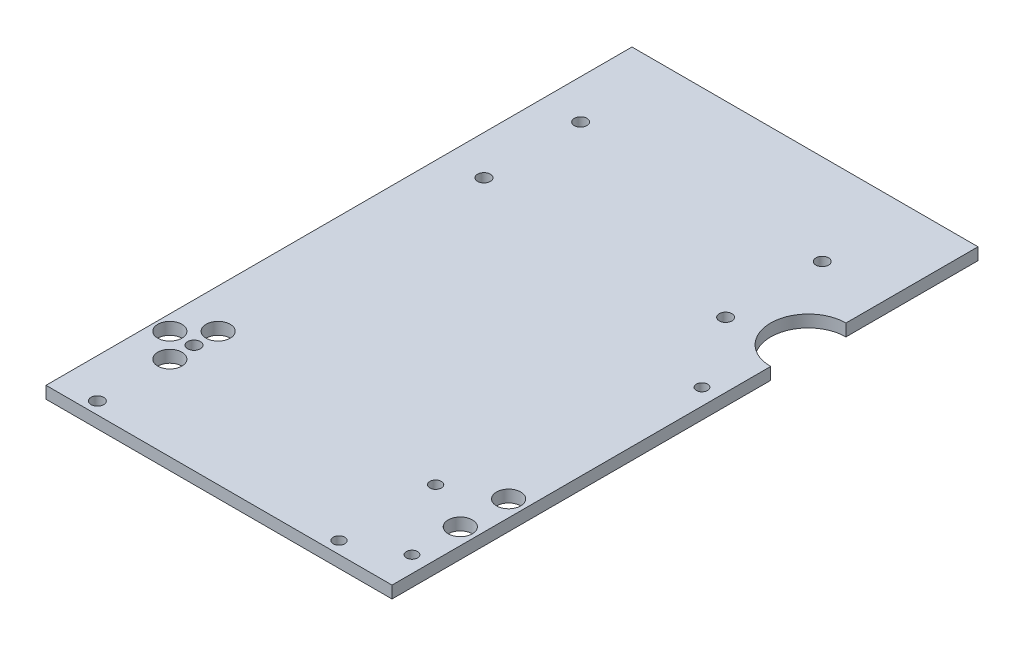
ISO-10303-21;
HEADER;
FILE_DESCRIPTION(('STEP AP214'),'2;1');
FILE_NAME('part.step','',(''),(''),'','','');
FILE_SCHEMA(('AUTOMOTIVE_DESIGN { 1 0 10303 214 1 1 1 1 }'));
ENDSEC;
DATA;
#1=APPLICATION_CONTEXT('core data for automotive mechanical design processes');
#2=APPLICATION_PROTOCOL_DEFINITION('international standard','automotive_design',2000,#1);
#3=PRODUCT_CONTEXT('',#1,'mechanical');
#4=PRODUCT('Part','Part','',(#3));
#5=PRODUCT_RELATED_PRODUCT_CATEGORY('part','',(#4));
#6=PRODUCT_DEFINITION_FORMATION('','',#4);
#7=PRODUCT_DEFINITION_CONTEXT('part definition',#1,'design');
#8=PRODUCT_DEFINITION('design','',#6,#7);
#9=PRODUCT_DEFINITION_SHAPE('','',#8);
#10=(LENGTH_UNIT() NAMED_UNIT(*) SI_UNIT(.MILLI.,.METRE.));
#11=(NAMED_UNIT(*) PLANE_ANGLE_UNIT() SI_UNIT($,.RADIAN.));
#12=(NAMED_UNIT(*) SI_UNIT($,.STERADIAN.) SOLID_ANGLE_UNIT());
#13=UNCERTAINTY_MEASURE_WITH_UNIT(LENGTH_MEASURE(1.E-05),#10,'distance_accuracy_value','');
#14=(GEOMETRIC_REPRESENTATION_CONTEXT(3) GLOBAL_UNCERTAINTY_ASSIGNED_CONTEXT((#13)) GLOBAL_UNIT_ASSIGNED_CONTEXT((#10,
#11,#12)) REPRESENTATION_CONTEXT('',''));
#15=CARTESIAN_POINT('',(0.,0.,0.));
#16=DIRECTION('',(0.,0.,1.));
#17=DIRECTION('',(1.,0.,0.));
#18=AXIS2_PLACEMENT_3D('',#15,#16,#17);
#19=CARTESIAN_POINT('',(-141.,-4.,139.759258716019));
#20=DIRECTION('',(-1.,0.,0.));
#21=DIRECTION('',(0.,0.,1.));
#22=AXIS2_PLACEMENT_3D('',#19,#20,#21);
#23=PLANE('',#22);
#24=DIRECTION('',(0.,0.,1.));
#25=VECTOR('',#24,1.);
#26=CARTESIAN_POINT('',(-141.,0.,139.759258716019));
#27=LINE('',#26,#25);
#28=CARTESIAN_POINT('',(-141.,0.,-54.2407412839806));
#29=VERTEX_POINT('',#28);
#30=CARTESIAN_POINT('',(-141.,0.,139.759258716019));
#31=VERTEX_POINT('',#30);
#32=EDGE_CURVE('E118',#29,#31,#27,.T.);
#33=ORIENTED_EDGE('',*,*,#32,.F.);
#34=DIRECTION('',(0.,1.,0.));
#35=VECTOR('',#34,1.);
#36=CARTESIAN_POINT('',(-141.,-4.,-54.2407412839806));
#37=LINE('',#36,#35);
#38=CARTESIAN_POINT('',(-141.,-4.,-54.2407412839806));
#39=VERTEX_POINT('',#38);
#40=EDGE_CURVE('E11',#39,#29,#37,.T.);
#41=ORIENTED_EDGE('',*,*,#40,.F.);
#42=DIRECTION('',(0.,0.,1.));
#43=VECTOR('',#42,1.);
#44=CARTESIAN_POINT('',(-141.,-4.,139.759258716019));
#45=LINE('',#44,#43);
#46=CARTESIAN_POINT('',(-141.,-4.,139.759258716019));
#47=VERTEX_POINT('',#46);
#48=EDGE_CURVE('E133',#39,#47,#45,.T.);
#49=ORIENTED_EDGE('',*,*,#48,.T.);
#50=DIRECTION('',(0.,1.,0.));
#51=VECTOR('',#50,1.);
#52=CARTESIAN_POINT('',(-141.,-4.,139.759258716019));
#53=LINE('',#52,#51);
#54=EDGE_CURVE('E36',#47,#31,#53,.T.);
#55=ORIENTED_EDGE('',*,*,#54,.T.);
#56=EDGE_LOOP('',(#33,#41,#49,#55));
#57=FACE_BOUND('',#56,.T.);
#58=ADVANCED_FACE('F33',(#57),#23,.T.);
#59=CARTESIAN_POINT('',(-141.,-4.,-54.2407412839806));
#60=DIRECTION('',(0.,0.,-1.));
#61=DIRECTION('',(-1.,0.,0.));
#62=AXIS2_PLACEMENT_3D('',#59,#60,#61);
#63=PLANE('',#62);
#64=DIRECTION('',(-1.,0.,0.));
#65=VECTOR('',#64,1.);
#66=CARTESIAN_POINT('',(-141.,0.,-54.2407412839806));
#67=LINE('',#66,#65);
#68=CARTESIAN_POINT('',(-26.44,0.,-54.2407412839806));
#69=VERTEX_POINT('',#68);
#70=EDGE_CURVE('E131',#69,#29,#67,.T.);
#71=ORIENTED_EDGE('',*,*,#70,.F.);
#72=DIRECTION('',(0.,1.,0.));
#73=VECTOR('',#72,1.);
#74=CARTESIAN_POINT('',(-26.44,-4.,-54.2407412839806));
#75=LINE('',#74,#73);
#76=CARTESIAN_POINT('',(-26.44,-4.,-54.2407412839806));
#77=VERTEX_POINT('',#76);
#78=EDGE_CURVE('E42',#77,#69,#75,.T.);
#79=ORIENTED_EDGE('',*,*,#78,.F.);
#80=DIRECTION('',(-1.,0.,0.));
#81=VECTOR('',#80,1.);
#82=CARTESIAN_POINT('',(-141.,-4.,-54.2407412839806));
#83=LINE('',#82,#81);
#84=EDGE_CURVE('E108',#77,#39,#83,.T.);
#85=ORIENTED_EDGE('',*,*,#84,.T.);
#86=ORIENTED_EDGE('',*,*,#40,.T.);
#87=EDGE_LOOP('',(#71,#79,#85,#86));
#88=FACE_BOUND('',#87,.T.);
#89=ADVANCED_FACE('F141',(#88),#63,.T.);
#90=CARTESIAN_POINT('',(-26.44,-4.,-10.5342735654368));
#91=DIRECTION('',(1.,0.,0.));
#92=DIRECTION('',(0.,0.,-1.));
#93=AXIS2_PLACEMENT_3D('',#90,#91,#92);
#94=PLANE('',#93);
#95=DIRECTION('',(0.,0.,-1.));
#96=VECTOR('',#95,1.);
#97=CARTESIAN_POINT('',(-26.44,0.,-10.5342735654368));
#98=LINE('',#97,#96);
#99=CARTESIAN_POINT('',(-26.44,0.,-10.5342735654368));
#100=VERTEX_POINT('',#99);
#101=EDGE_CURVE('E95',#100,#69,#98,.T.);
#102=ORIENTED_EDGE('',*,*,#101,.F.);
#103=DIRECTION('',(0.,1.,0.));
#104=VECTOR('',#103,1.);
#105=CARTESIAN_POINT('',(-26.44,-4.,-10.5342735654368));
#106=LINE('',#105,#104);
#107=CARTESIAN_POINT('',(-26.44,-4.,-10.5342735654368));
#108=VERTEX_POINT('',#107);
#109=EDGE_CURVE('E90',#108,#100,#106,.T.);
#110=ORIENTED_EDGE('',*,*,#109,.F.);
#111=DIRECTION('',(0.,0.,-1.));
#112=VECTOR('',#111,1.);
#113=CARTESIAN_POINT('',(-26.44,-4.,-10.5342735654368));
#114=LINE('',#113,#112);
#115=EDGE_CURVE('E93',#108,#77,#114,.T.);
#116=ORIENTED_EDGE('',*,*,#115,.T.);
#117=ORIENTED_EDGE('',*,*,#78,.T.);
#118=EDGE_LOOP('',(#102,#110,#116,#117));
#119=FACE_BOUND('',#118,.T.);
#120=ADVANCED_FACE('F92',(#119),#94,.T.);
#121=CARTESIAN_POINT('',(-26.44,-4.,1.93325471929562));
#122=DIRECTION('',(0.,1.,0.));
#123=DIRECTION('',(0.,0.,1.));
#124=AXIS2_PLACEMENT_3D('',#121,#122,#123);
#125=CYLINDRICAL_SURFACE('',#124,12.4675282847324);
#126=CARTESIAN_POINT('',(-26.44,0.,1.93325471929562));
#127=DIRECTION('',(0.,-1.,0.));
#128=DIRECTION('',(0.,0.,1.));
#129=AXIS2_PLACEMENT_3D('',#126,#127,#128);
#130=CIRCLE('',#129,12.4675282847324);
#131=CARTESIAN_POINT('',(-26.44,0.,14.400783004028));
#132=VERTEX_POINT('',#131);
#133=EDGE_CURVE('E128',#132,#100,#130,.T.);
#134=ORIENTED_EDGE('',*,*,#133,.F.);
#135=DIRECTION('',(0.,1.,0.));
#136=VECTOR('',#135,1.);
#137=CARTESIAN_POINT('',(-26.44,-4.,14.400783004028));
#138=LINE('',#137,#136);
#139=CARTESIAN_POINT('',(-26.44,-4.,14.400783004028));
#140=VERTEX_POINT('',#139);
#141=EDGE_CURVE('E100',#140,#132,#138,.T.);
#142=ORIENTED_EDGE('',*,*,#141,.F.);
#143=CARTESIAN_POINT('',(-26.44,-4.,1.93325471929562));
#144=DIRECTION('',(0.,-1.,0.));
#145=DIRECTION('',(0.,0.,1.));
#146=AXIS2_PLACEMENT_3D('',#143,#144,#145);
#147=CIRCLE('',#146,12.4675282847324);
#148=EDGE_CURVE('E106',#140,#108,#147,.T.);
#149=ORIENTED_EDGE('',*,*,#148,.T.);
#150=ORIENTED_EDGE('',*,*,#109,.T.);
#151=EDGE_LOOP('',(#134,#142,#149,#150));
#152=FACE_BOUND('',#151,.T.);
#153=ADVANCED_FACE('F110',(#152),#125,.F.);
#154=CARTESIAN_POINT('',(-26.44,-4.,139.759258716019));
#155=DIRECTION('',(1.,0.,0.));
#156=DIRECTION('',(0.,0.,-1.));
#157=AXIS2_PLACEMENT_3D('',#154,#155,#156);
#158=PLANE('',#157);
#159=DIRECTION('',(0.,0.,-1.));
#160=VECTOR('',#159,1.);
#161=CARTESIAN_POINT('',(-26.44,0.,139.759258716019));
#162=LINE('',#161,#160);
#163=CARTESIAN_POINT('',(-26.44,0.,139.759258716019));
#164=VERTEX_POINT('',#163);
#165=EDGE_CURVE('E125',#164,#132,#162,.T.);
#166=ORIENTED_EDGE('',*,*,#165,.F.);
#167=DIRECTION('',(0.,1.,0.));
#168=VECTOR('',#167,1.);
#169=CARTESIAN_POINT('',(-26.44,-4.,139.759258716019));
#170=LINE('',#169,#168);
#171=CARTESIAN_POINT('',(-26.44,-4.,139.759258716019));
#172=VERTEX_POINT('',#171);
#173=EDGE_CURVE('E136',#172,#164,#170,.T.);
#174=ORIENTED_EDGE('',*,*,#173,.F.);
#175=DIRECTION('',(0.,0.,-1.));
#176=VECTOR('',#175,1.);
#177=CARTESIAN_POINT('',(-26.44,-4.,139.759258716019));
#178=LINE('',#177,#176);
#179=EDGE_CURVE('E111',#172,#140,#178,.T.);
#180=ORIENTED_EDGE('',*,*,#179,.T.);
#181=ORIENTED_EDGE('',*,*,#141,.T.);
#182=EDGE_LOOP('',(#166,#174,#180,#181));
#183=FACE_BOUND('',#182,.T.);
#184=ADVANCED_FACE('F154',(#183),#158,.T.);
#185=CARTESIAN_POINT('',(-141.,-4.,139.759258716019));
#186=DIRECTION('',(0.,0.,1.));
#187=DIRECTION('',(1.,0.,0.));
#188=AXIS2_PLACEMENT_3D('',#185,#186,#187);
#189=PLANE('',#188);
#190=DIRECTION('',(1.,0.,0.));
#191=VECTOR('',#190,1.);
#192=CARTESIAN_POINT('',(-141.,0.,139.759258716019));
#193=LINE('',#192,#191);
#194=EDGE_CURVE('E121',#31,#164,#193,.T.);
#195=ORIENTED_EDGE('',*,*,#194,.F.);
#196=ORIENTED_EDGE('',*,*,#54,.F.);
#197=DIRECTION('',(1.,0.,0.));
#198=VECTOR('',#197,1.);
#199=CARTESIAN_POINT('',(-141.,-4.,139.759258716019));
#200=LINE('',#199,#198);
#201=EDGE_CURVE('E113',#47,#172,#200,.T.);
#202=ORIENTED_EDGE('',*,*,#201,.T.);
#203=ORIENTED_EDGE('',*,*,#173,.T.);
#204=EDGE_LOOP('',(#195,#196,#202,#203));
#205=FACE_BOUND('',#204,.T.);
#206=ADVANCED_FACE('F138',(#205),#189,.T.);
#207=CARTESIAN_POINT('',(-26.44,-4.,1.93325471929562));
#208=DIRECTION('',(0.,1.,0.));
#209=DIRECTION('',(0.,0.,1.));
#210=AXIS2_PLACEMENT_3D('',#207,#208,#209);
#211=PLANE('',#210);
#212=CARTESIAN_POINT('',(-31.84,-4.,95.759258716019));
#213=DIRECTION('',(0.,1.,0.));
#214=DIRECTION('',(0.,0.,1.));
#215=AXIS2_PLACEMENT_3D('',#212,#213,#214);
#216=CIRCLE('',#215,4.);
#217=CARTESIAN_POINT('',(-31.84,-4.,99.759258716019));
#218=VERTEX_POINT('',#217);
#219=EDGE_CURVE('E232',#218,#218,#216,.T.);
#220=ORIENTED_EDGE('',*,*,#219,.T.);
#221=EDGE_LOOP('',(#220));
#222=FACE_BOUND('',#221,.T.);
#223=CARTESIAN_POINT('',(-31.84,-4.,111.759258716019));
#224=DIRECTION('',(0.,1.,0.));
#225=DIRECTION('',(0.,0.,1.));
#226=AXIS2_PLACEMENT_3D('',#223,#224,#225);
#227=CIRCLE('',#226,4.);
#228=CARTESIAN_POINT('',(-31.84,-4.,115.759258716019));
#229=VERTEX_POINT('',#228);
#230=EDGE_CURVE('E240',#229,#229,#227,.T.);
#231=ORIENTED_EDGE('',*,*,#230,.T.);
#232=EDGE_LOOP('',(#231));
#233=FACE_BOUND('',#232,.T.);
#234=CARTESIAN_POINT('',(-48.0000000000998,-4.,-24.2407412838807));
#235=DIRECTION('',(0.,1.,0.));
#236=DIRECTION('',(0.,0.,1.));
#237=AXIS2_PLACEMENT_3D('',#234,#235,#236);
#238=CIRCLE('',#237,2.10000000010002);
#239=CARTESIAN_POINT('',(-48.0000000000998,-4.,-22.1407412837806));
#240=VERTEX_POINT('',#239);
#241=EDGE_CURVE('E246',#240,#240,#238,.T.);
#242=ORIENTED_EDGE('',*,*,#241,.T.);
#243=EDGE_LOOP('',(#242));
#244=FACE_BOUND('',#243,.T.);
#245=CARTESIAN_POINT('',(-48.0000000001001,-4.,7.75925871611929));
#246=DIRECTION('',(0.,1.,0.));
#247=DIRECTION('',(0.,0.,1.));
#248=AXIS2_PLACEMENT_3D('',#245,#246,#247);
#249=CIRCLE('',#248,2.10000000009999);
#250=CARTESIAN_POINT('',(-48.0000000001001,-4.,9.85925871621929));
#251=VERTEX_POINT('',#250);
#252=EDGE_CURVE('E252',#251,#251,#249,.T.);
#253=ORIENTED_EDGE('',*,*,#252,.T.);
#254=EDGE_LOOP('',(#253));
#255=FACE_BOUND('',#254,.T.);
#256=CARTESIAN_POINT('',(-128.0000000001,-4.,-24.2407412838806));
#257=DIRECTION('',(0.,1.,0.));
#258=DIRECTION('',(0.,0.,1.));
#259=AXIS2_PLACEMENT_3D('',#256,#257,#258);
#260=CIRCLE('',#259,2.10000000010003);
#261=CARTESIAN_POINT('',(-128.0000000001,-4.,-22.1407412837806));
#262=VERTEX_POINT('',#261);
#263=EDGE_CURVE('E258',#262,#262,#260,.T.);
#264=ORIENTED_EDGE('',*,*,#263,.T.);
#265=EDGE_LOOP('',(#264));
#266=FACE_BOUND('',#265,.T.);
#267=CARTESIAN_POINT('',(-128.0000000001,-4.,7.75925871611985));
#268=DIRECTION('',(0.,1.,0.));
#269=DIRECTION('',(0.,0.,1.));
#270=AXIS2_PLACEMENT_3D('',#267,#268,#269);
#271=CIRCLE('',#270,2.10000000010003);
#272=CARTESIAN_POINT('',(-128.0000000001,-4.,9.85925871621988));
#273=VERTEX_POINT('',#272);
#274=EDGE_CURVE('E264',#273,#273,#271,.T.);
#275=ORIENTED_EDGE('',*,*,#274,.T.);
#276=EDGE_LOOP('',(#275));
#277=FACE_BOUND('',#276,.T.);
#278=CARTESIAN_POINT('',(-128.,-4.,111.759258716019));
#279=DIRECTION('',(0.,1.,0.));
#280=DIRECTION('',(0.,0.,1.));
#281=AXIS2_PLACEMENT_3D('',#278,#279,#280);
#282=CIRCLE('',#281,4.00000000000001);
#283=CARTESIAN_POINT('',(-128.,-4.,115.759258716019));
#284=VERTEX_POINT('',#283);
#285=EDGE_CURVE('E270',#284,#284,#282,.T.);
#286=ORIENTED_EDGE('',*,*,#285,.T.);
#287=EDGE_LOOP('',(#286));
#288=FACE_BOUND('',#287,.T.);
#289=CARTESIAN_POINT('',(-128.,-4.,95.7592587160191));
#290=DIRECTION('',(0.,1.,0.));
#291=DIRECTION('',(0.,0.,1.));
#292=AXIS2_PLACEMENT_3D('',#289,#290,#291);
#293=CIRCLE('',#292,3.99999999999999);
#294=CARTESIAN_POINT('',(-128.,-4.,99.7592587160191));
#295=VERTEX_POINT('',#294);
#296=EDGE_CURVE('E276',#295,#295,#293,.T.);
#297=ORIENTED_EDGE('',*,*,#296,.T.);
#298=EDGE_LOOP('',(#297));
#299=FACE_BOUND('',#298,.T.);
#300=CARTESIAN_POINT('',(-136.,-4.,103.759258716019));
#301=DIRECTION('',(0.,1.,0.));
#302=DIRECTION('',(0.,0.,1.));
#303=AXIS2_PLACEMENT_3D('',#300,#301,#302);
#304=CIRCLE('',#303,3.99999999999999);
#305=CARTESIAN_POINT('',(-136.,-4.,107.759258716019));
#306=VERTEX_POINT('',#305);
#307=EDGE_CURVE('E282',#306,#306,#304,.T.);
#308=ORIENTED_EDGE('',*,*,#307,.T.);
#309=EDGE_LOOP('',(#308));
#310=FACE_BOUND('',#309,.T.);
#311=CARTESIAN_POINT('',(-127.9999999999,-4.,103.759258715919));
#312=DIRECTION('',(0.,1.,0.));
#313=DIRECTION('',(0.,0.,1.));
#314=AXIS2_PLACEMENT_3D('',#311,#312,#313);
#315=CIRCLE('',#314,2.10000000010003);
#316=CARTESIAN_POINT('',(-127.9999999999,-4.,105.859258716019));
#317=VERTEX_POINT('',#316);
#318=EDGE_CURVE('E288',#317,#317,#315,.T.);
#319=ORIENTED_EDGE('',*,*,#318,.T.);
#320=EDGE_LOOP('',(#319));
#321=FACE_BOUND('',#320,.T.);
#322=CARTESIAN_POINT('',(-127.9999999999,-4.,135.759258715919));
#323=DIRECTION('',(0.,1.,0.));
#324=DIRECTION('',(0.,0.,1.));
#325=AXIS2_PLACEMENT_3D('',#322,#323,#324);
#326=CIRCLE('',#325,2.10000000010001);
#327=CARTESIAN_POINT('',(-127.9999999999,-4.,137.859258716019));
#328=VERTEX_POINT('',#327);
#329=EDGE_CURVE('E294',#328,#328,#326,.T.);
#330=ORIENTED_EDGE('',*,*,#329,.T.);
#331=EDGE_LOOP('',(#330));
#332=FACE_BOUND('',#331,.T.);
#333=CARTESIAN_POINT('',(-47.9999999999008,-4.,103.759258715919));
#334=DIRECTION('',(0.,1.,0.));
#335=DIRECTION('',(0.,0.,1.));
#336=AXIS2_PLACEMENT_3D('',#333,#334,#335);
#337=CIRCLE('',#336,1.905);
#338=CARTESIAN_POINT('',(-47.9999999999008,-4.,105.664258715919));
#339=VERTEX_POINT('',#338);
#340=EDGE_CURVE('E300',#339,#339,#337,.T.);
#341=ORIENTED_EDGE('',*,*,#340,.T.);
#342=EDGE_LOOP('',(#341));
#343=FACE_BOUND('',#342,.T.);
#344=CARTESIAN_POINT('',(-47.9999999999001,-4.,135.759258715919));
#345=DIRECTION('',(0.,1.,0.));
#346=DIRECTION('',(0.,0.,1.));
#347=AXIS2_PLACEMENT_3D('',#344,#345,#346);
#348=CIRCLE('',#347,1.905);
#349=CARTESIAN_POINT('',(-47.9999999999001,-4.,137.664258715919));
#350=VERTEX_POINT('',#349);
#351=EDGE_CURVE('E306',#350,#350,#348,.T.);
#352=ORIENTED_EDGE('',*,*,#351,.T.);
#353=EDGE_LOOP('',(#352));
#354=FACE_BOUND('',#353,.T.);
#355=CARTESIAN_POINT('',(-31.84,-4.,127.759258716019));
#356=DIRECTION('',(0.,1.,0.));
#357=DIRECTION('',(0.,0.,1.));
#358=AXIS2_PLACEMENT_3D('',#355,#356,#357);
#359=CIRCLE('',#358,1.85000000000002);
#360=CARTESIAN_POINT('',(-31.84,-4.,129.609258716019));
#361=VERTEX_POINT('',#360);
#362=EDGE_CURVE('E312',#361,#361,#359,.T.);
#363=ORIENTED_EDGE('',*,*,#362,.T.);
#364=EDGE_LOOP('',(#363));
#365=FACE_BOUND('',#364,.T.);
#366=CARTESIAN_POINT('',(-31.84,-4.,31.759258716019));
#367=DIRECTION('',(0.,1.,0.));
#368=DIRECTION('',(0.,0.,1.));
#369=AXIS2_PLACEMENT_3D('',#366,#367,#368);
#370=CIRCLE('',#369,1.84999999999999);
#371=CARTESIAN_POINT('',(-31.84,-4.,33.609258716019));
#372=VERTEX_POINT('',#371);
#373=EDGE_CURVE('E122',#372,#372,#370,.T.);
#374=ORIENTED_EDGE('',*,*,#373,.T.);
#375=EDGE_LOOP('',(#374));
#376=FACE_BOUND('',#375,.T.);
#377=ORIENTED_EDGE('',*,*,#48,.F.);
#378=ORIENTED_EDGE('',*,*,#84,.F.);
#379=ORIENTED_EDGE('',*,*,#115,.F.);
#380=ORIENTED_EDGE('',*,*,#148,.F.);
#381=ORIENTED_EDGE('',*,*,#179,.F.);
#382=ORIENTED_EDGE('',*,*,#201,.F.);
#383=EDGE_LOOP('',(#377,#378,#379,#380,#381,#382));
#384=FACE_BOUND('',#383,.T.);
#385=ADVANCED_FACE('F104',(#222,#233,#244,#255,#266,#277,#288,#299,#310,#321,#332,#343,#354,
#365,#376,#384),#211,.F.);
#386=CARTESIAN_POINT('',(-26.44,0.,1.93325471929562));
#387=DIRECTION('',(0.,1.,0.));
#388=DIRECTION('',(0.,0.,1.));
#389=AXIS2_PLACEMENT_3D('',#386,#387,#388);
#390=PLANE('',#389);
#391=CARTESIAN_POINT('',(-31.84,0.,95.759258716019));
#392=DIRECTION('',(0.,1.,0.));
#393=DIRECTION('',(0.,0.,1.));
#394=AXIS2_PLACEMENT_3D('',#391,#392,#393);
#395=CIRCLE('',#394,4.);
#396=CARTESIAN_POINT('',(-31.84,0.,99.759258716019));
#397=VERTEX_POINT('',#396);
#398=EDGE_CURVE('E235',#397,#397,#395,.T.);
#399=ORIENTED_EDGE('',*,*,#398,.F.);
#400=EDGE_LOOP('',(#399));
#401=FACE_BOUND('',#400,.T.);
#402=CARTESIAN_POINT('',(-31.84,0.,111.759258716019));
#403=DIRECTION('',(0.,1.,0.));
#404=DIRECTION('',(0.,0.,1.));
#405=AXIS2_PLACEMENT_3D('',#402,#403,#404);
#406=CIRCLE('',#405,4.);
#407=CARTESIAN_POINT('',(-31.84,0.,115.759258716019));
#408=VERTEX_POINT('',#407);
#409=EDGE_CURVE('E237',#408,#408,#406,.T.);
#410=ORIENTED_EDGE('',*,*,#409,.F.);
#411=EDGE_LOOP('',(#410));
#412=FACE_BOUND('',#411,.T.);
#413=CARTESIAN_POINT('',(-48.0000000000998,0.,-24.2407412838807));
#414=DIRECTION('',(0.,1.,0.));
#415=DIRECTION('',(0.,0.,1.));
#416=AXIS2_PLACEMENT_3D('',#413,#414,#415);
#417=CIRCLE('',#416,2.10000000010002);
#418=CARTESIAN_POINT('',(-48.0000000000998,0.,-22.1407412837806));
#419=VERTEX_POINT('',#418);
#420=EDGE_CURVE('E243',#419,#419,#417,.T.);
#421=ORIENTED_EDGE('',*,*,#420,.F.);
#422=EDGE_LOOP('',(#421));
#423=FACE_BOUND('',#422,.T.);
#424=CARTESIAN_POINT('',(-48.0000000001001,0.,7.75925871611929));
#425=DIRECTION('',(0.,1.,0.));
#426=DIRECTION('',(0.,0.,1.));
#427=AXIS2_PLACEMENT_3D('',#424,#425,#426);
#428=CIRCLE('',#427,2.10000000009999);
#429=CARTESIAN_POINT('',(-48.0000000001001,0.,9.85925871621929));
#430=VERTEX_POINT('',#429);
#431=EDGE_CURVE('E249',#430,#430,#428,.T.);
#432=ORIENTED_EDGE('',*,*,#431,.F.);
#433=EDGE_LOOP('',(#432));
#434=FACE_BOUND('',#433,.T.);
#435=CARTESIAN_POINT('',(-128.0000000001,0.,-24.2407412838806));
#436=DIRECTION('',(0.,1.,0.));
#437=DIRECTION('',(0.,0.,1.));
#438=AXIS2_PLACEMENT_3D('',#435,#436,#437);
#439=CIRCLE('',#438,2.10000000010003);
#440=CARTESIAN_POINT('',(-128.0000000001,0.,-22.1407412837806));
#441=VERTEX_POINT('',#440);
#442=EDGE_CURVE('E255',#441,#441,#439,.T.);
#443=ORIENTED_EDGE('',*,*,#442,.F.);
#444=EDGE_LOOP('',(#443));
#445=FACE_BOUND('',#444,.T.);
#446=CARTESIAN_POINT('',(-128.0000000001,0.,7.75925871611985));
#447=DIRECTION('',(0.,1.,0.));
#448=DIRECTION('',(0.,0.,1.));
#449=AXIS2_PLACEMENT_3D('',#446,#447,#448);
#450=CIRCLE('',#449,2.10000000010003);
#451=CARTESIAN_POINT('',(-128.0000000001,0.,9.85925871621988));
#452=VERTEX_POINT('',#451);
#453=EDGE_CURVE('E261',#452,#452,#450,.T.);
#454=ORIENTED_EDGE('',*,*,#453,.F.);
#455=EDGE_LOOP('',(#454));
#456=FACE_BOUND('',#455,.T.);
#457=CARTESIAN_POINT('',(-128.,0.,111.759258716019));
#458=DIRECTION('',(0.,1.,0.));
#459=DIRECTION('',(0.,0.,1.));
#460=AXIS2_PLACEMENT_3D('',#457,#458,#459);
#461=CIRCLE('',#460,4.00000000000001);
#462=CARTESIAN_POINT('',(-128.,0.,115.759258716019));
#463=VERTEX_POINT('',#462);
#464=EDGE_CURVE('E267',#463,#463,#461,.T.);
#465=ORIENTED_EDGE('',*,*,#464,.F.);
#466=EDGE_LOOP('',(#465));
#467=FACE_BOUND('',#466,.T.);
#468=CARTESIAN_POINT('',(-128.,0.,95.7592587160191));
#469=DIRECTION('',(0.,1.,0.));
#470=DIRECTION('',(0.,0.,1.));
#471=AXIS2_PLACEMENT_3D('',#468,#469,#470);
#472=CIRCLE('',#471,3.99999999999999);
#473=CARTESIAN_POINT('',(-128.,0.,99.7592587160191));
#474=VERTEX_POINT('',#473);
#475=EDGE_CURVE('E273',#474,#474,#472,.T.);
#476=ORIENTED_EDGE('',*,*,#475,.F.);
#477=EDGE_LOOP('',(#476));
#478=FACE_BOUND('',#477,.T.);
#479=CARTESIAN_POINT('',(-136.,0.,103.759258716019));
#480=DIRECTION('',(0.,1.,0.));
#481=DIRECTION('',(0.,0.,1.));
#482=AXIS2_PLACEMENT_3D('',#479,#480,#481);
#483=CIRCLE('',#482,3.99999999999999);
#484=CARTESIAN_POINT('',(-136.,0.,107.759258716019));
#485=VERTEX_POINT('',#484);
#486=EDGE_CURVE('E279',#485,#485,#483,.T.);
#487=ORIENTED_EDGE('',*,*,#486,.F.);
#488=EDGE_LOOP('',(#487));
#489=FACE_BOUND('',#488,.T.);
#490=CARTESIAN_POINT('',(-127.9999999999,0.,103.759258715919));
#491=DIRECTION('',(0.,1.,0.));
#492=DIRECTION('',(0.,0.,1.));
#493=AXIS2_PLACEMENT_3D('',#490,#491,#492);
#494=CIRCLE('',#493,2.10000000010003);
#495=CARTESIAN_POINT('',(-127.9999999999,0.,105.859258716019));
#496=VERTEX_POINT('',#495);
#497=EDGE_CURVE('E285',#496,#496,#494,.T.);
#498=ORIENTED_EDGE('',*,*,#497,.F.);
#499=EDGE_LOOP('',(#498));
#500=FACE_BOUND('',#499,.T.);
#501=CARTESIAN_POINT('',(-127.9999999999,0.,135.759258715919));
#502=DIRECTION('',(0.,1.,0.));
#503=DIRECTION('',(0.,0.,1.));
#504=AXIS2_PLACEMENT_3D('',#501,#502,#503);
#505=CIRCLE('',#504,2.10000000010001);
#506=CARTESIAN_POINT('',(-127.9999999999,0.,137.859258716019));
#507=VERTEX_POINT('',#506);
#508=EDGE_CURVE('E291',#507,#507,#505,.T.);
#509=ORIENTED_EDGE('',*,*,#508,.F.);
#510=EDGE_LOOP('',(#509));
#511=FACE_BOUND('',#510,.T.);
#512=CARTESIAN_POINT('',(-47.9999999999008,0.,103.759258715919));
#513=DIRECTION('',(0.,1.,0.));
#514=DIRECTION('',(0.,0.,1.));
#515=AXIS2_PLACEMENT_3D('',#512,#513,#514);
#516=CIRCLE('',#515,1.905);
#517=CARTESIAN_POINT('',(-47.9999999999008,0.,105.664258715919));
#518=VERTEX_POINT('',#517);
#519=EDGE_CURVE('E297',#518,#518,#516,.T.);
#520=ORIENTED_EDGE('',*,*,#519,.F.);
#521=EDGE_LOOP('',(#520));
#522=FACE_BOUND('',#521,.T.);
#523=CARTESIAN_POINT('',(-47.9999999999001,0.,135.759258715919));
#524=DIRECTION('',(0.,1.,0.));
#525=DIRECTION('',(0.,0.,1.));
#526=AXIS2_PLACEMENT_3D('',#523,#524,#525);
#527=CIRCLE('',#526,1.905);
#528=CARTESIAN_POINT('',(-47.9999999999001,0.,137.664258715919));
#529=VERTEX_POINT('',#528);
#530=EDGE_CURVE('E303',#529,#529,#527,.T.);
#531=ORIENTED_EDGE('',*,*,#530,.F.);
#532=EDGE_LOOP('',(#531));
#533=FACE_BOUND('',#532,.T.);
#534=CARTESIAN_POINT('',(-31.84,0.,127.759258716019));
#535=DIRECTION('',(0.,1.,0.));
#536=DIRECTION('',(0.,0.,1.));
#537=AXIS2_PLACEMENT_3D('',#534,#535,#536);
#538=CIRCLE('',#537,1.85000000000002);
#539=CARTESIAN_POINT('',(-31.84,0.,129.609258716019));
#540=VERTEX_POINT('',#539);
#541=EDGE_CURVE('E309',#540,#540,#538,.T.);
#542=ORIENTED_EDGE('',*,*,#541,.F.);
#543=EDGE_LOOP('',(#542));
#544=FACE_BOUND('',#543,.T.);
#545=CARTESIAN_POINT('',(-31.84,0.,31.759258716019));
#546=DIRECTION('',(0.,1.,0.));
#547=DIRECTION('',(0.,0.,1.));
#548=AXIS2_PLACEMENT_3D('',#545,#546,#547);
#549=CIRCLE('',#548,1.84999999999999);
#550=CARTESIAN_POINT('',(-31.84,0.,33.609258716019));
#551=VERTEX_POINT('',#550);
#552=EDGE_CURVE('E315',#551,#551,#549,.T.);
#553=ORIENTED_EDGE('',*,*,#552,.F.);
#554=EDGE_LOOP('',(#553));
#555=FACE_BOUND('',#554,.T.);
#556=ORIENTED_EDGE('',*,*,#32,.T.);
#557=ORIENTED_EDGE('',*,*,#194,.T.);
#558=ORIENTED_EDGE('',*,*,#165,.T.);
#559=ORIENTED_EDGE('',*,*,#133,.T.);
#560=ORIENTED_EDGE('',*,*,#101,.T.);
#561=ORIENTED_EDGE('',*,*,#70,.T.);
#562=EDGE_LOOP('',(#556,#557,#558,#559,#560,#561));
#563=FACE_BOUND('',#562,.T.);
#564=ADVANCED_FACE('F140',(#401,#412,#423,#434,#445,#456,#467,#478,#489,#500,#511,#522,#533,
#544,#555,#563),#390,.T.);
#565=CARTESIAN_POINT('',(-31.84,-4.,31.759258716019));
#566=DIRECTION('',(0.,1.,0.));
#567=DIRECTION('',(0.,0.,1.));
#568=AXIS2_PLACEMENT_3D('',#565,#566,#567);
#569=CYLINDRICAL_SURFACE('',#568,1.84999999999999);
#570=ORIENTED_EDGE('',*,*,#373,.F.);
#571=EDGE_LOOP('',(#570));
#572=FACE_BOUND('',#571,.T.);
#573=ORIENTED_EDGE('',*,*,#552,.T.);
#574=EDGE_LOOP('',(#573));
#575=FACE_BOUND('',#574,.T.);
#576=ADVANCED_FACE('F165',(#572,#575),#569,.F.);
#577=CARTESIAN_POINT('',(-31.84,-4.,127.759258716019));
#578=DIRECTION('',(0.,1.,0.));
#579=DIRECTION('',(0.,0.,1.));
#580=AXIS2_PLACEMENT_3D('',#577,#578,#579);
#581=CYLINDRICAL_SURFACE('',#580,1.85000000000002);
#582=ORIENTED_EDGE('',*,*,#362,.F.);
#583=EDGE_LOOP('',(#582));
#584=FACE_BOUND('',#583,.T.);
#585=ORIENTED_EDGE('',*,*,#541,.T.);
#586=EDGE_LOOP('',(#585));
#587=FACE_BOUND('',#586,.T.);
#588=ADVANCED_FACE('F172',(#584,#587),#581,.F.);
#589=CARTESIAN_POINT('',(-47.9999999999001,-4.,135.759258715919));
#590=DIRECTION('',(0.,1.,0.));
#591=DIRECTION('',(0.,0.,1.));
#592=AXIS2_PLACEMENT_3D('',#589,#590,#591);
#593=CYLINDRICAL_SURFACE('',#592,1.905);
#594=ORIENTED_EDGE('',*,*,#351,.F.);
#595=EDGE_LOOP('',(#594));
#596=FACE_BOUND('',#595,.T.);
#597=ORIENTED_EDGE('',*,*,#530,.T.);
#598=EDGE_LOOP('',(#597));
#599=FACE_BOUND('',#598,.T.);
#600=ADVANCED_FACE('F176',(#596,#599),#593,.F.);
#601=CARTESIAN_POINT('',(-47.9999999999008,-4.,103.759258715919));
#602=DIRECTION('',(0.,1.,0.));
#603=DIRECTION('',(0.,0.,1.));
#604=AXIS2_PLACEMENT_3D('',#601,#602,#603);
#605=CYLINDRICAL_SURFACE('',#604,1.905);
#606=ORIENTED_EDGE('',*,*,#340,.F.);
#607=EDGE_LOOP('',(#606));
#608=FACE_BOUND('',#607,.T.);
#609=ORIENTED_EDGE('',*,*,#519,.T.);
#610=EDGE_LOOP('',(#609));
#611=FACE_BOUND('',#610,.T.);
#612=ADVANCED_FACE('F180',(#608,#611),#605,.F.);
#613=CARTESIAN_POINT('',(-127.9999999999,-4.,135.759258715919));
#614=DIRECTION('',(0.,1.,0.));
#615=DIRECTION('',(0.,0.,1.));
#616=AXIS2_PLACEMENT_3D('',#613,#614,#615);
#617=CYLINDRICAL_SURFACE('',#616,2.10000000010001);
#618=ORIENTED_EDGE('',*,*,#329,.F.);
#619=EDGE_LOOP('',(#618));
#620=FACE_BOUND('',#619,.T.);
#621=ORIENTED_EDGE('',*,*,#508,.T.);
#622=EDGE_LOOP('',(#621));
#623=FACE_BOUND('',#622,.T.);
#624=ADVANCED_FACE('F184',(#620,#623),#617,.F.);
#625=CARTESIAN_POINT('',(-127.9999999999,-4.,103.759258715919));
#626=DIRECTION('',(0.,1.,0.));
#627=DIRECTION('',(0.,0.,1.));
#628=AXIS2_PLACEMENT_3D('',#625,#626,#627);
#629=CYLINDRICAL_SURFACE('',#628,2.10000000010003);
#630=ORIENTED_EDGE('',*,*,#318,.F.);
#631=EDGE_LOOP('',(#630));
#632=FACE_BOUND('',#631,.T.);
#633=ORIENTED_EDGE('',*,*,#497,.T.);
#634=EDGE_LOOP('',(#633));
#635=FACE_BOUND('',#634,.T.);
#636=ADVANCED_FACE('F188',(#632,#635),#629,.F.);
#637=CARTESIAN_POINT('',(-136.,-4.,103.759258716019));
#638=DIRECTION('',(0.,1.,0.));
#639=DIRECTION('',(0.,0.,1.));
#640=AXIS2_PLACEMENT_3D('',#637,#638,#639);
#641=CYLINDRICAL_SURFACE('',#640,3.99999999999999);
#642=ORIENTED_EDGE('',*,*,#307,.F.);
#643=EDGE_LOOP('',(#642));
#644=FACE_BOUND('',#643,.T.);
#645=ORIENTED_EDGE('',*,*,#486,.T.);
#646=EDGE_LOOP('',(#645));
#647=FACE_BOUND('',#646,.T.);
#648=ADVANCED_FACE('F192',(#644,#647),#641,.F.);
#649=CARTESIAN_POINT('',(-128.,-4.,95.7592587160191));
#650=DIRECTION('',(0.,1.,0.));
#651=DIRECTION('',(0.,0.,1.));
#652=AXIS2_PLACEMENT_3D('',#649,#650,#651);
#653=CYLINDRICAL_SURFACE('',#652,3.99999999999999);
#654=ORIENTED_EDGE('',*,*,#296,.F.);
#655=EDGE_LOOP('',(#654));
#656=FACE_BOUND('',#655,.T.);
#657=ORIENTED_EDGE('',*,*,#475,.T.);
#658=EDGE_LOOP('',(#657));
#659=FACE_BOUND('',#658,.T.);
#660=ADVANCED_FACE('F196',(#656,#659),#653,.F.);
#661=CARTESIAN_POINT('',(-128.,-4.,111.759258716019));
#662=DIRECTION('',(0.,1.,0.));
#663=DIRECTION('',(0.,0.,1.));
#664=AXIS2_PLACEMENT_3D('',#661,#662,#663);
#665=CYLINDRICAL_SURFACE('',#664,4.00000000000001);
#666=ORIENTED_EDGE('',*,*,#285,.F.);
#667=EDGE_LOOP('',(#666));
#668=FACE_BOUND('',#667,.T.);
#669=ORIENTED_EDGE('',*,*,#464,.T.);
#670=EDGE_LOOP('',(#669));
#671=FACE_BOUND('',#670,.T.);
#672=ADVANCED_FACE('F200',(#668,#671),#665,.F.);
#673=CARTESIAN_POINT('',(-128.0000000001,-4.,7.75925871611985));
#674=DIRECTION('',(0.,1.,0.));
#675=DIRECTION('',(0.,0.,1.));
#676=AXIS2_PLACEMENT_3D('',#673,#674,#675);
#677=CYLINDRICAL_SURFACE('',#676,2.10000000010003);
#678=ORIENTED_EDGE('',*,*,#274,.F.);
#679=EDGE_LOOP('',(#678));
#680=FACE_BOUND('',#679,.T.);
#681=ORIENTED_EDGE('',*,*,#453,.T.);
#682=EDGE_LOOP('',(#681));
#683=FACE_BOUND('',#682,.T.);
#684=ADVANCED_FACE('F204',(#680,#683),#677,.F.);
#685=CARTESIAN_POINT('',(-128.0000000001,-4.,-24.2407412838806));
#686=DIRECTION('',(0.,1.,0.));
#687=DIRECTION('',(0.,0.,1.));
#688=AXIS2_PLACEMENT_3D('',#685,#686,#687);
#689=CYLINDRICAL_SURFACE('',#688,2.10000000010003);
#690=ORIENTED_EDGE('',*,*,#263,.F.);
#691=EDGE_LOOP('',(#690));
#692=FACE_BOUND('',#691,.T.);
#693=ORIENTED_EDGE('',*,*,#442,.T.);
#694=EDGE_LOOP('',(#693));
#695=FACE_BOUND('',#694,.T.);
#696=ADVANCED_FACE('F208',(#692,#695),#689,.F.);
#697=CARTESIAN_POINT('',(-48.0000000001001,-4.,7.75925871611929));
#698=DIRECTION('',(0.,1.,0.));
#699=DIRECTION('',(0.,0.,1.));
#700=AXIS2_PLACEMENT_3D('',#697,#698,#699);
#701=CYLINDRICAL_SURFACE('',#700,2.10000000009999);
#702=ORIENTED_EDGE('',*,*,#252,.F.);
#703=EDGE_LOOP('',(#702));
#704=FACE_BOUND('',#703,.T.);
#705=ORIENTED_EDGE('',*,*,#431,.T.);
#706=EDGE_LOOP('',(#705));
#707=FACE_BOUND('',#706,.T.);
#708=ADVANCED_FACE('F212',(#704,#707),#701,.F.);
#709=CARTESIAN_POINT('',(-48.0000000000998,-4.,-24.2407412838807));
#710=DIRECTION('',(0.,1.,0.));
#711=DIRECTION('',(0.,0.,1.));
#712=AXIS2_PLACEMENT_3D('',#709,#710,#711);
#713=CYLINDRICAL_SURFACE('',#712,2.10000000010002);
#714=ORIENTED_EDGE('',*,*,#241,.F.);
#715=EDGE_LOOP('',(#714));
#716=FACE_BOUND('',#715,.T.);
#717=ORIENTED_EDGE('',*,*,#420,.T.);
#718=EDGE_LOOP('',(#717));
#719=FACE_BOUND('',#718,.T.);
#720=ADVANCED_FACE('F216',(#716,#719),#713,.F.);
#721=CARTESIAN_POINT('',(-31.84,-4.,111.759258716019));
#722=DIRECTION('',(0.,1.,0.));
#723=DIRECTION('',(0.,0.,1.));
#724=AXIS2_PLACEMENT_3D('',#721,#722,#723);
#725=CYLINDRICAL_SURFACE('',#724,4.);
#726=ORIENTED_EDGE('',*,*,#230,.F.);
#727=EDGE_LOOP('',(#726));
#728=FACE_BOUND('',#727,.T.);
#729=ORIENTED_EDGE('',*,*,#409,.T.);
#730=EDGE_LOOP('',(#729));
#731=FACE_BOUND('',#730,.T.);
#732=ADVANCED_FACE('F220',(#728,#731),#725,.F.);
#733=CARTESIAN_POINT('',(-31.84,-4.,95.759258716019));
#734=DIRECTION('',(0.,1.,0.));
#735=DIRECTION('',(0.,0.,1.));
#736=AXIS2_PLACEMENT_3D('',#733,#734,#735);
#737=CYLINDRICAL_SURFACE('',#736,4.);
#738=ORIENTED_EDGE('',*,*,#219,.F.);
#739=EDGE_LOOP('',(#738));
#740=FACE_BOUND('',#739,.T.);
#741=ORIENTED_EDGE('',*,*,#398,.T.);
#742=EDGE_LOOP('',(#741));
#743=FACE_BOUND('',#742,.T.);
#744=ADVANCED_FACE('F224',(#740,#743),#737,.F.);
#745=CLOSED_SHELL('',(#58,#89,#120,#153,#184,#206,#385,#564,#576,#588,#600,#612,#624,#636,#648,
#660,#672,#684,#696,#708,#720,#732,#744));
#746=MANIFOLD_SOLID_BREP('B2',#745);
#747=ADVANCED_BREP_SHAPE_REPRESENTATION('',(#18,#746),#14);
#748=SHAPE_DEFINITION_REPRESENTATION(#9,#747);
ENDSEC;
END-ISO-10303-21;
